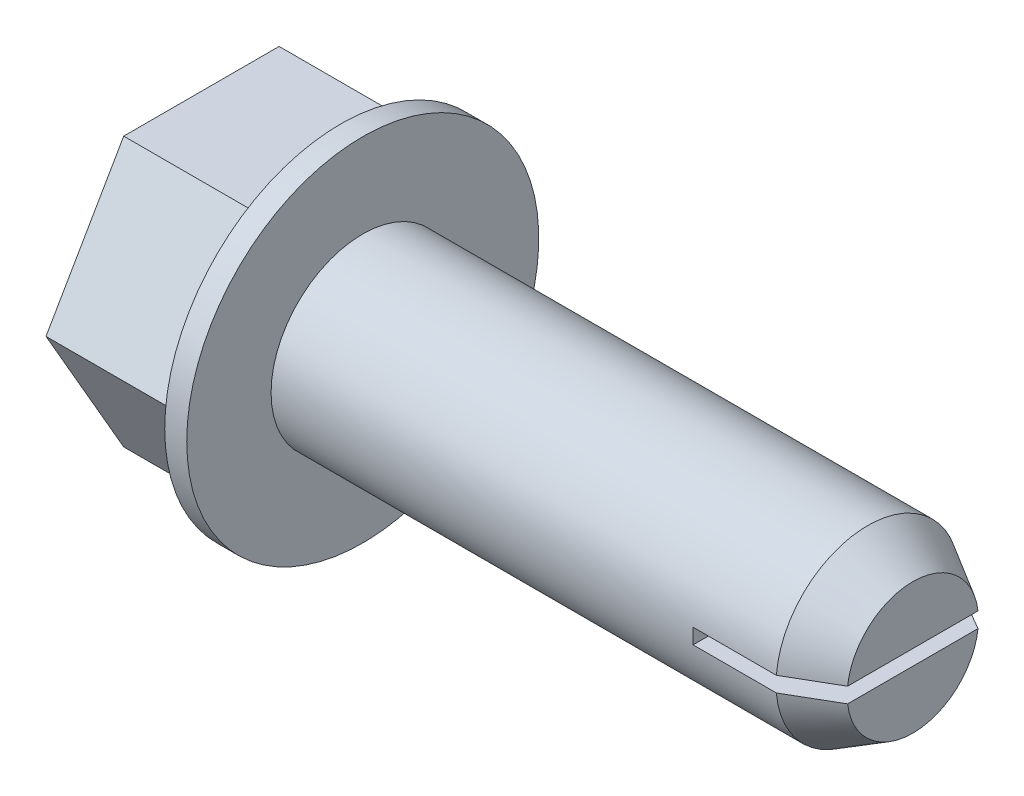
ISO-10303-21;
HEADER;
FILE_DESCRIPTION(('STEP AP214'),'2;1');
FILE_NAME('part.step','',(''),(''),'','','');
FILE_SCHEMA(('AUTOMOTIVE_DESIGN { 1 0 10303 214 1 1 1 1 }'));
ENDSEC;
DATA;
#1=APPLICATION_CONTEXT('core data for automotive mechanical design processes');
#2=APPLICATION_PROTOCOL_DEFINITION('international standard','automotive_design',2000,#1);
#3=PRODUCT_CONTEXT('',#1,'mechanical');
#4=PRODUCT('Part','Part','',(#3));
#5=PRODUCT_RELATED_PRODUCT_CATEGORY('part','',(#4));
#6=PRODUCT_DEFINITION_FORMATION('','',#4);
#7=PRODUCT_DEFINITION_CONTEXT('part definition',#1,'design');
#8=PRODUCT_DEFINITION('design','',#6,#7);
#9=PRODUCT_DEFINITION_SHAPE('','',#8);
#10=(LENGTH_UNIT() NAMED_UNIT(*) SI_UNIT(.MILLI.,.METRE.));
#11=(NAMED_UNIT(*) PLANE_ANGLE_UNIT() SI_UNIT($,.RADIAN.));
#12=(NAMED_UNIT(*) SI_UNIT($,.STERADIAN.) SOLID_ANGLE_UNIT());
#13=UNCERTAINTY_MEASURE_WITH_UNIT(LENGTH_MEASURE(1.E-05),#10,'distance_accuracy_value','');
#14=(GEOMETRIC_REPRESENTATION_CONTEXT(3) GLOBAL_UNCERTAINTY_ASSIGNED_CONTEXT((#13)) GLOBAL_UNIT_ASSIGNED_CONTEXT((#10,
#11,#12)) REPRESENTATION_CONTEXT('',''));
#15=CARTESIAN_POINT('',(0.,0.,0.));
#16=DIRECTION('',(0.,0.,1.));
#17=DIRECTION('',(1.,0.,0.));
#18=AXIS2_PLACEMENT_3D('',#15,#16,#17);
#19=CARTESIAN_POINT('',(-4.6228,3.72872,0.));
#20=DIRECTION('',(1.,0.,0.));
#21=DIRECTION('',(0.,0.,-1.));
#22=AXIS2_PLACEMENT_3D('',#19,#20,#21);
#23=PLANE('',#22);
#24=CARTESIAN_POINT('',(-4.6228,0.,0.));
#25=DIRECTION('',(-1.,0.,0.));
#26=DIRECTION('',(0.,0.,1.));
#27=AXIS2_PLACEMENT_3D('',#24,#25,#26);
#28=CIRCLE('',#27,3.72872);
#29=CARTESIAN_POINT('',(-4.6228,0.,3.72872));
#30=VERTEX_POINT('',#29);
#31=EDGE_CURVE('E19',#30,#30,#28,.T.);
#32=ORIENTED_EDGE('',*,*,#31,.T.);
#33=EDGE_LOOP('',(#32));
#34=FACE_BOUND('',#33,.T.);
#35=ADVANCED_FACE('F16',(#34),#23,.F.);
#36=CARTESIAN_POINT('',(0.,0.,0.));
#37=DIRECTION('',(-1.,0.,0.));
#38=DIRECTION('',(0.,0.,1.));
#39=AXIS2_PLACEMENT_3D('',#36,#37,#38);
#40=CYLINDRICAL_SURFACE('',#39,3.72872);
#41=ORIENTED_EDGE('',*,*,#31,.F.);
#42=EDGE_LOOP('',(#41));
#43=FACE_BOUND('',#42,.T.);
#44=CARTESIAN_POINT('',(-5.588,0.,0.));
#45=DIRECTION('',(-1.,0.,0.));
#46=DIRECTION('',(0.,0.,1.));
#47=AXIS2_PLACEMENT_3D('',#44,#45,#46);
#48=CIRCLE('',#47,3.72872);
#49=CARTESIAN_POINT('',(-5.588,0.,3.72872));
#50=VERTEX_POINT('',#49);
#51=EDGE_CURVE('E151',#50,#50,#48,.T.);
#52=ORIENTED_EDGE('',*,*,#51,.T.);
#53=EDGE_LOOP('',(#52));
#54=FACE_BOUND('',#53,.T.);
#55=ADVANCED_FACE('F250',(#43,#54),#40,.F.);
#56=CARTESIAN_POINT('',(-5.588,4.6609,0.));
#57=DIRECTION('',(1.,0.,0.));
#58=DIRECTION('',(0.,0.,-1.));
#59=AXIS2_PLACEMENT_3D('',#56,#57,#58);
#60=PLANE('',#59);
#61=DIRECTION('',(0.,0.,-1.));
#62=VECTOR('',#61,1.);
#63=CARTESIAN_POINT('',(-5.58799999998882,-4.6609,0.));
#64=LINE('',#63,#62);
#65=CARTESIAN_POINT('',(-5.58800000007968,-4.6609,2.69097186966593));
#66=VERTEX_POINT('',#65);
#67=CARTESIAN_POINT('',(-5.58799999999441,-4.6609,-2.69097186966593));
#68=VERTEX_POINT('',#67);
#69=EDGE_CURVE('E147',#66,#68,#64,.T.);
#70=ORIENTED_EDGE('',*,*,#69,.F.);
#71=DIRECTION('',(0.,-0.866025403784439,-0.5));
#72=VECTOR('',#71,1.);
#73=CARTESIAN_POINT('',(-5.5880000002162,-10.7431892055105,-0.820639440424718));
#74=LINE('',#73,#72);
#75=CARTESIAN_POINT('',(-5.58800000007968,0.,5.38194373933185));
#76=VERTEX_POINT('',#75);
#77=EDGE_CURVE('E142',#76,#66,#74,.T.);
#78=ORIENTED_EDGE('',*,*,#77,.F.);
#79=DIRECTION('',(0.,-0.866025403784439,0.5));
#80=VECTOR('',#79,1.);
#81=CARTESIAN_POINT('',(-5.58799999998882,-6.08228920551051,8.8935550494225));
#82=LINE('',#81,#80);
#83=CARTESIAN_POINT('',(-5.58799999999441,4.6609,2.69097186966593));
#84=VERTEX_POINT('',#83);
#85=EDGE_CURVE('E138',#84,#76,#82,.T.);
#86=ORIENTED_EDGE('',*,*,#85,.F.);
#87=DIRECTION('',(0.,0.,1.));
#88=VECTOR('',#87,1.);
#89=CARTESIAN_POINT('',(-5.58799999998882,4.6609,0.));
#90=LINE('',#89,#88);
#91=CARTESIAN_POINT('',(-5.58800000007968,4.6609,-2.69097186966593));
#92=VERTEX_POINT('',#91);
#93=EDGE_CURVE('E161',#92,#84,#90,.T.);
#94=ORIENTED_EDGE('',*,*,#93,.F.);
#95=DIRECTION('',(0.,0.866025403784439,0.5));
#96=VECTOR('',#95,1.);
#97=CARTESIAN_POINT('',(-5.5880000002162,-6.08228920551051,-8.8935550494225));
#98=LINE('',#97,#96);
#99=CARTESIAN_POINT('',(-5.58800000016215,0.,-5.38194373933185));
#100=VERTEX_POINT('',#99);
#101=EDGE_CURVE('E338',#100,#92,#98,.T.);
#102=ORIENTED_EDGE('',*,*,#101,.F.);
#103=DIRECTION('',(0.,0.866025403784439,-0.5));
#104=VECTOR('',#103,1.);
#105=CARTESIAN_POINT('',(-5.58799999998882,-10.7431892055105,0.82063944042472));
#106=LINE('',#105,#104);
#107=EDGE_CURVE('E328',#68,#100,#106,.T.);
#108=ORIENTED_EDGE('',*,*,#107,.F.);
#109=EDGE_LOOP('',(#70,#78,#86,#94,#102,#108));
#110=FACE_BOUND('',#109,.T.);
#111=ORIENTED_EDGE('',*,*,#51,.F.);
#112=EDGE_LOOP('',(#111));
#113=FACE_BOUND('',#112,.T.);
#114=ADVANCED_FACE('F144',(#110,#113),#60,.F.);
#115=CARTESIAN_POINT('',(500000.,-10.7431892055105,-0.820639440424718));
#116=DIRECTION('',(0.,-0.5,0.866025403784439));
#117=DIRECTION('',(0.,-0.866025403784439,-0.5));
#118=AXIS2_PLACEMENT_3D('',#115,#116,#117);
#119=PLANE('',#118);
#120=DIRECTION('',(0.,0.866025403784439,0.5));
#121=VECTOR('',#120,1.);
#122=CARTESIAN_POINT('',(-0.762,-4.6609,2.69097186966593));
#123=LINE('',#122,#121);
#124=CARTESIAN_POINT('',(-0.762000000091873,-4.6609,2.69097186966593));
#125=VERTEX_POINT('',#124);
#126=CARTESIAN_POINT('',(-0.762000000177139,0.,5.38194373933185));
#127=VERTEX_POINT('',#126);
#128=EDGE_CURVE('E157',#125,#127,#123,.T.);
#129=ORIENTED_EDGE('',*,*,#128,.T.);
#130=DIRECTION('',(1.,0.,0.));
#131=VECTOR('',#130,1.);
#132=CARTESIAN_POINT('',(500000.,0.,5.38194373933185));
#133=LINE('',#132,#131);
#134=EDGE_CURVE('E154',#76,#127,#133,.T.);
#135=ORIENTED_EDGE('',*,*,#134,.F.);
#136=ORIENTED_EDGE('',*,*,#77,.T.);
#137=DIRECTION('',(1.,0.,0.));
#138=VECTOR('',#137,1.);
#139=CARTESIAN_POINT('',(500000.,-4.6609,2.69097186966593));
#140=LINE('',#139,#138);
#141=EDGE_CURVE('E320',#125,#66,#140,.F.);
#142=ORIENTED_EDGE('',*,*,#141,.F.);
#143=EDGE_LOOP('',(#129,#135,#136,#142));
#144=FACE_BOUND('',#143,.T.);
#145=ADVANCED_FACE('F155',(#144),#119,.T.);
#146=CARTESIAN_POINT('',(500000.,-6.08228920551051,8.8935550494225));
#147=DIRECTION('',(0.,0.5,0.866025403784439));
#148=DIRECTION('',(0.,-0.866025403784439,0.5));
#149=AXIS2_PLACEMENT_3D('',#146,#147,#148);
#150=PLANE('',#149);
#151=DIRECTION('',(0.,0.866025403784439,-0.5));
#152=VECTOR('',#151,1.);
#153=CARTESIAN_POINT('',(-0.762,0.,5.38194373933185));
#154=LINE('',#153,#152);
#155=CARTESIAN_POINT('',(-0.762000000006608,4.6609,2.69097186966593));
#156=VERTEX_POINT('',#155);
#157=EDGE_CURVE('E315',#127,#156,#154,.T.);
#158=ORIENTED_EDGE('',*,*,#157,.T.);
#159=DIRECTION('',(1.,0.,0.));
#160=VECTOR('',#159,1.);
#161=CARTESIAN_POINT('',(500000.,4.6609,2.69097186966592));
#162=LINE('',#161,#160);
#163=EDGE_CURVE('E165',#84,#156,#162,.T.);
#164=ORIENTED_EDGE('',*,*,#163,.F.);
#165=ORIENTED_EDGE('',*,*,#85,.T.);
#166=ORIENTED_EDGE('',*,*,#134,.T.);
#167=EDGE_LOOP('',(#158,#164,#165,#166));
#168=FACE_BOUND('',#167,.T.);
#169=ADVANCED_FACE('F163',(#168),#150,.T.);
#170=CARTESIAN_POINT('',(500000.,4.6609,0.));
#171=DIRECTION('',(0.,1.,0.));
#172=DIRECTION('',(0.,0.,1.));
#173=AXIS2_PLACEMENT_3D('',#170,#171,#172);
#174=PLANE('',#173);
#175=DIRECTION('',(0.,0.,-1.));
#176=VECTOR('',#175,1.);
#177=CARTESIAN_POINT('',(-0.762,4.6609,0.));
#178=LINE('',#177,#176);
#179=CARTESIAN_POINT('',(-0.762000000049241,4.6609,-2.69097186966592));
#180=VERTEX_POINT('',#179);
#181=EDGE_CURVE('E312',#156,#180,#178,.T.);
#182=ORIENTED_EDGE('',*,*,#181,.T.);
#183=DIRECTION('',(1.,0.,0.));
#184=VECTOR('',#183,1.);
#185=CARTESIAN_POINT('',(500000.,4.6609,-2.69097186966592));
#186=LINE('',#185,#184);
#187=EDGE_CURVE('E335',#92,#180,#186,.T.);
#188=ORIENTED_EDGE('',*,*,#187,.F.);
#189=ORIENTED_EDGE('',*,*,#93,.T.);
#190=ORIENTED_EDGE('',*,*,#163,.T.);
#191=EDGE_LOOP('',(#182,#188,#189,#190));
#192=FACE_BOUND('',#191,.T.);
#193=ADVANCED_FACE('F345',(#192),#174,.T.);
#194=CARTESIAN_POINT('',(500000.,-6.08228920551051,-8.8935550494225));
#195=DIRECTION('',(0.,0.5,-0.866025403784439));
#196=DIRECTION('',(0.,0.866025403784439,0.5));
#197=AXIS2_PLACEMENT_3D('',#194,#195,#196);
#198=PLANE('',#197);
#199=DIRECTION('',(0.,-0.866025403784439,-0.5));
#200=VECTOR('',#199,1.);
#201=CARTESIAN_POINT('',(-0.762,4.6609,-2.69097186966593));
#202=LINE('',#201,#200);
#203=CARTESIAN_POINT('',(-0.762000000148717,0.,-5.38194373933185));
#204=VERTEX_POINT('',#203);
#205=EDGE_CURVE('E309',#180,#204,#202,.T.);
#206=ORIENTED_EDGE('',*,*,#205,.T.);
#207=DIRECTION('',(1.,0.,0.));
#208=VECTOR('',#207,1.);
#209=CARTESIAN_POINT('',(500000.,0.,-5.38194373933185));
#210=LINE('',#209,#208);
#211=EDGE_CURVE('E332',#100,#204,#210,.T.);
#212=ORIENTED_EDGE('',*,*,#211,.F.);
#213=ORIENTED_EDGE('',*,*,#101,.T.);
#214=ORIENTED_EDGE('',*,*,#187,.T.);
#215=EDGE_LOOP('',(#206,#212,#213,#214));
#216=FACE_BOUND('',#215,.T.);
#217=ADVANCED_FACE('F349',(#216),#198,.T.);
#218=CARTESIAN_POINT('',(500000.,-10.7431892055105,0.82063944042472));
#219=DIRECTION('',(0.,-0.5,-0.866025403784439));
#220=DIRECTION('',(0.,0.866025403784439,-0.5));
#221=AXIS2_PLACEMENT_3D('',#218,#219,#220);
#222=PLANE('',#221);
#223=DIRECTION('',(1.,0.,0.));
#224=VECTOR('',#223,1.);
#225=CARTESIAN_POINT('',(500000.,-4.6609,-2.69097186966593));
#226=LINE('',#225,#224);
#227=CARTESIAN_POINT('',(-0.761999999949765,-4.6609,-2.69097186966593));
#228=VERTEX_POINT('',#227);
#229=EDGE_CURVE('E323',#68,#228,#226,.T.);
#230=ORIENTED_EDGE('',*,*,#229,.F.);
#231=ORIENTED_EDGE('',*,*,#107,.T.);
#232=ORIENTED_EDGE('',*,*,#211,.T.);
#233=DIRECTION('',(0.,-0.866025403784439,0.499999999999999));
#234=VECTOR('',#233,1.);
#235=CARTESIAN_POINT('',(-0.762,0.,-5.38194373933185));
#236=LINE('',#235,#234);
#237=EDGE_CURVE('E99',#204,#228,#236,.T.);
#238=ORIENTED_EDGE('',*,*,#237,.T.);
#239=EDGE_LOOP('',(#230,#231,#232,#238));
#240=FACE_BOUND('',#239,.T.);
#241=ADVANCED_FACE('F351',(#240),#222,.T.);
#242=CARTESIAN_POINT('',(500000.,-4.6609,0.));
#243=DIRECTION('',(0.,-1.,0.));
#244=DIRECTION('',(0.,0.,-1.));
#245=AXIS2_PLACEMENT_3D('',#242,#243,#244);
#246=PLANE('',#245);
#247=DIRECTION('',(0.,0.,-1.));
#248=VECTOR('',#247,1.);
#249=CARTESIAN_POINT('',(-0.762,-4.6609,0.));
#250=LINE('',#249,#248);
#251=EDGE_CURVE('E239',#228,#125,#250,.F.);
#252=ORIENTED_EDGE('',*,*,#251,.T.);
#253=ORIENTED_EDGE('',*,*,#141,.T.);
#254=ORIENTED_EDGE('',*,*,#69,.T.);
#255=ORIENTED_EDGE('',*,*,#229,.T.);
#256=EDGE_LOOP('',(#252,#253,#254,#255));
#257=FACE_BOUND('',#256,.T.);
#258=ADVANCED_FACE('F354',(#257),#246,.T.);
#259=CARTESIAN_POINT('',(-0.762,6.096,0.));
#260=DIRECTION('',(1.,0.,0.));
#261=DIRECTION('',(0.,0.,-1.));
#262=AXIS2_PLACEMENT_3D('',#259,#260,#261);
#263=PLANE('',#262);
#264=CARTESIAN_POINT('',(-0.762,0.,0.));
#265=DIRECTION('',(-1.,0.,0.));
#266=DIRECTION('',(0.,0.,1.));
#267=AXIS2_PLACEMENT_3D('',#264,#265,#266);
#268=CIRCLE('',#267,6.096);
#269=CARTESIAN_POINT('',(-0.762,0.,6.096));
#270=VERTEX_POINT('',#269);
#271=EDGE_CURVE('E236',#270,#270,#268,.F.);
#272=ORIENTED_EDGE('',*,*,#271,.F.);
#273=EDGE_LOOP('',(#272));
#274=FACE_BOUND('',#273,.T.);
#275=ORIENTED_EDGE('',*,*,#237,.F.);
#276=ORIENTED_EDGE('',*,*,#205,.F.);
#277=ORIENTED_EDGE('',*,*,#181,.F.);
#278=ORIENTED_EDGE('',*,*,#157,.F.);
#279=ORIENTED_EDGE('',*,*,#128,.F.);
#280=ORIENTED_EDGE('',*,*,#251,.F.);
#281=EDGE_LOOP('',(#275,#276,#277,#278,#279,#280));
#282=FACE_BOUND('',#281,.T.);
#283=ADVANCED_FACE('F356',(#274,#282),#263,.F.);
#284=CARTESIAN_POINT('',(19.05,3.175,0.));
#285=DIRECTION('',(-1.,0.,0.));
#286=DIRECTION('',(0.,0.,1.));
#287=AXIS2_PLACEMENT_3D('',#284,#285,#286);
#288=PLANE('',#287);
#289=DIRECTION('',(0.,0.,-1.));
#290=VECTOR('',#289,1.);
#291=CARTESIAN_POINT('',(19.05,-0.264583333333333,-6.096));
#292=LINE('',#291,#290);
#293=CARTESIAN_POINT('',(19.0500000000004,-0.264583333333333,-2.25785042680903));
#294=VERTEX_POINT('',#293);
#295=CARTESIAN_POINT('',(19.0499999999965,-0.264583333333333,2.25785042681133));
#296=VERTEX_POINT('',#295);
#297=EDGE_CURVE('E233',#294,#296,#292,.F.);
#298=ORIENTED_EDGE('',*,*,#297,.T.);
#299=CARTESIAN_POINT('',(19.0499999999929,0.,0.));
#300=DIRECTION('',(-1.,0.,0.));
#301=DIRECTION('',(0.,0.,1.));
#302=AXIS2_PLACEMENT_3D('',#299,#300,#301);
#303=CIRCLE('',#302,2.27330000003061);
#304=EDGE_CURVE('E87',#294,#296,#303,.T.);
#305=ORIENTED_EDGE('',*,*,#304,.F.);
#306=EDGE_LOOP('',(#298,#305));
#307=FACE_BOUND('',#306,.T.);
#308=ADVANCED_FACE('F358',(#307),#288,.F.);
#309=CARTESIAN_POINT('',(0.,0.,0.));
#310=DIRECTION('',(-1.,0.,0.));
#311=DIRECTION('',(0.,0.,1.));
#312=AXIS2_PLACEMENT_3D('',#309,#310,#311);
#313=CYLINDRICAL_SURFACE('',#312,6.096);
#314=ORIENTED_EDGE('',*,*,#271,.T.);
#315=EDGE_LOOP('',(#314));
#316=FACE_BOUND('',#315,.T.);
#317=CARTESIAN_POINT('',(0.,0.,0.));
#318=DIRECTION('',(-1.,0.,0.));
#319=DIRECTION('',(0.,0.,1.));
#320=AXIS2_PLACEMENT_3D('',#317,#318,#319);
#321=CIRCLE('',#320,6.096);
#322=CARTESIAN_POINT('',(0.,0.,6.096));
#323=VERTEX_POINT('',#322);
#324=EDGE_CURVE('E283',#323,#323,#321,.T.);
#325=ORIENTED_EDGE('',*,*,#324,.T.);
#326=EDGE_LOOP('',(#325));
#327=FACE_BOUND('',#326,.T.);
#328=ADVANCED_FACE('F365',(#316,#327),#313,.T.);
#329=CARTESIAN_POINT('',(17.488209787075,0.,0.));
#330=DIRECTION('',(-1.,0.,0.));
#331=DIRECTION('',(0.,0.,1.));
#332=AXIS2_PLACEMENT_3D('',#329,#330,#331);
#333=CONICAL_SURFACE('',#332,3.17499999988513,0.523598775602448);
#334=CARTESIAN_POINT('',(17.4882097868304,-0.264583333333333,-3.16395648830533));
#335=CARTESIAN_POINT('',(17.7485950521458,-0.264583333333333,-3.01308870934584));
#336=CARTESIAN_POINT('',(18.0089562455111,-0.264583333333333,-2.86217927282826));
#337=CARTESIAN_POINT('',(18.3994183217583,-0.264583333333333,-2.63567773139847));
#338=CARTESIAN_POINT('',(18.5295590617472,-0.264583333333333,-2.56015431969282));
#339=CARTESIAN_POINT('',(18.7898067189707,-0.264583333333333,-2.40904920796175));
#340=CARTESIAN_POINT('',(18.9199136362009,-0.264583333333333,-2.333467507929));
#341=CARTESIAN_POINT('',(19.0500000000079,-0.264583333333333,-2.25785042680467));
#342=B_SPLINE_CURVE_WITH_KNOTS('',3,(#334,#335,#336,#337,#338,#339,#340,#341),.UNSPECIFIED.,.F.,
.F.,(4,2,2,4),(0.,0.902803568709945,1.35420535449983,1.80560719706211),.UNSPECIFIED.);
#343=CARTESIAN_POINT('',(17.4882097868228,-0.264583333333333,-3.16395648829212));
#344=VERTEX_POINT('',#343);
#345=EDGE_CURVE('E227',#344,#294,#342,.T.);
#346=ORIENTED_EDGE('',*,*,#345,.T.);
#347=ORIENTED_EDGE('',*,*,#304,.T.);
#348=CARTESIAN_POINT('',(19.0500000000073,-0.264583333333333,2.257850426805));
#349=CARTESIAN_POINT('',(18.9199136362004,-0.264583333333333,2.3334675079293));
#350=CARTESIAN_POINT('',(18.7898067189702,-0.264583333333333,2.40904920796202));
#351=CARTESIAN_POINT('',(18.5295590617469,-0.264583333333333,2.56015431969304));
#352=CARTESIAN_POINT('',(18.3994183217579,-0.264583333333333,2.63567773139866));
#353=CARTESIAN_POINT('',(18.0089562455109,-0.264583333333333,2.86217927282837));
#354=CARTESIAN_POINT('',(17.7485950521457,-0.264583333333333,3.01308870934589));
#355=CARTESIAN_POINT('',(17.4882097868304,-0.264583333333333,3.16395648830533));
#356=B_SPLINE_CURVE_WITH_KNOTS('',3,(#348,#349,#350,#351,#352,#353,#354,#355),.UNSPECIFIED.,.F.,
.F.,(4,2,2,4),(0.,0.451401842562117,0.902803628351839,1.80560719706146),.UNSPECIFIED.);
#357=CARTESIAN_POINT('',(17.4882097868228,-0.264583333333333,3.16395648829212));
#358=VERTEX_POINT('',#357);
#359=EDGE_CURVE('E221',#296,#358,#356,.T.);
#360=ORIENTED_EDGE('',*,*,#359,.T.);
#361=CARTESIAN_POINT('',(17.4882097868151,0.,0.));
#362=DIRECTION('',(-1.,0.,0.));
#363=DIRECTION('',(0.,0.,1.));
#364=AXIS2_PLACEMENT_3D('',#361,#362,#363);
#365=CIRCLE('',#364,3.175);
#366=EDGE_CURVE('E293',#344,#358,#365,.T.);
#367=ORIENTED_EDGE('',*,*,#366,.F.);
#368=EDGE_LOOP('',(#346,#347,#360,#367));
#369=FACE_BOUND('',#368,.T.);
#370=ADVANCED_FACE('F215',(#369),#333,.T.);
#371=CARTESIAN_POINT('',(14.605,-0.264583333333333,-6.096));
#372=DIRECTION('',(0.,-1.,0.));
#373=DIRECTION('',(0.,0.,-1.));
#374=AXIS2_PLACEMENT_3D('',#371,#372,#373);
#375=PLANE('',#374);
#376=ORIENTED_EDGE('',*,*,#297,.F.);
#377=ORIENTED_EDGE('',*,*,#345,.F.);
#378=DIRECTION('',(-1.,0.,0.));
#379=VECTOR('',#378,1.);
#380=CARTESIAN_POINT('',(0.,-0.264583333333333,-3.16395648827891));
#381=LINE('',#380,#379);
#382=CARTESIAN_POINT('',(14.605,-0.264583333333333,-3.16395648827891));
#383=VERTEX_POINT('',#382);
#384=EDGE_CURVE('E297',#383,#344,#381,.F.);
#385=ORIENTED_EDGE('',*,*,#384,.F.);
#386=DIRECTION('',(0.,0.,1.));
#387=VECTOR('',#386,1.);
#388=CARTESIAN_POINT('',(14.605,-0.264583333333333,-6.096));
#389=LINE('',#388,#387);
#390=CARTESIAN_POINT('',(14.605,-0.264583333333333,3.16395648827891));
#391=VERTEX_POINT('',#390);
#392=EDGE_CURVE('E280',#383,#391,#389,.T.);
#393=ORIENTED_EDGE('',*,*,#392,.T.);
#394=DIRECTION('',(-1.,0.,0.));
#395=VECTOR('',#394,1.);
#396=CARTESIAN_POINT('',(0.,-0.264583333333333,3.16395648827891));
#397=LINE('',#396,#395);
#398=EDGE_CURVE('E288',#358,#391,#397,.T.);
#399=ORIENTED_EDGE('',*,*,#398,.F.);
#400=ORIENTED_EDGE('',*,*,#359,.F.);
#401=EDGE_LOOP('',(#376,#377,#385,#393,#399,#400));
#402=FACE_BOUND('',#401,.T.);
#403=ADVANCED_FACE('F210',(#402),#375,.F.);
#404=CARTESIAN_POINT('',(14.605,0.264583333333333,-6.096));
#405=DIRECTION('',(-1.,0.,0.));
#406=DIRECTION('',(0.,0.,1.));
#407=AXIS2_PLACEMENT_3D('',#404,#405,#406);
#408=PLANE('',#407);
#409=DIRECTION('',(0.,0.,1.));
#410=VECTOR('',#409,1.);
#411=CARTESIAN_POINT('',(14.605,0.264583333333333,-6.096));
#412=LINE('',#411,#410);
#413=CARTESIAN_POINT('',(14.605,0.264583333333334,-3.16395648827891));
#414=VERTEX_POINT('',#413);
#415=CARTESIAN_POINT('',(14.605,0.264583333333333,3.16395648827891));
#416=VERTEX_POINT('',#415);
#417=EDGE_CURVE('E284',#414,#416,#412,.T.);
#418=ORIENTED_EDGE('',*,*,#417,.T.);
#419=CARTESIAN_POINT('',(14.605,0.,0.));
#420=DIRECTION('',(-1.,0.,0.));
#421=DIRECTION('',(0.,0.,1.));
#422=AXIS2_PLACEMENT_3D('',#419,#420,#421);
#423=CIRCLE('',#422,3.175);
#424=EDGE_CURVE('E292',#391,#416,#423,.T.);
#425=ORIENTED_EDGE('',*,*,#424,.F.);
#426=ORIENTED_EDGE('',*,*,#392,.F.);
#427=CARTESIAN_POINT('',(14.605,0.,0.));
#428=DIRECTION('',(-1.,0.,0.));
#429=DIRECTION('',(0.,0.,1.));
#430=AXIS2_PLACEMENT_3D('',#427,#428,#429);
#431=CIRCLE('',#430,3.175);
#432=EDGE_CURVE('E301',#414,#383,#431,.T.);
#433=ORIENTED_EDGE('',*,*,#432,.F.);
#434=EDGE_LOOP('',(#418,#425,#426,#433));
#435=FACE_BOUND('',#434,.T.);
#436=ADVANCED_FACE('F206',(#435),#408,.F.);
#437=CARTESIAN_POINT('',(19.05,3.175,0.));
#438=DIRECTION('',(-1.,0.,0.));
#439=DIRECTION('',(0.,0.,1.));
#440=AXIS2_PLACEMENT_3D('',#437,#438,#439);
#441=PLANE('',#440);
#442=DIRECTION('',(0.,0.,1.));
#443=VECTOR('',#442,1.);
#444=CARTESIAN_POINT('',(19.05,0.264583333333333,-6.096));
#445=LINE('',#444,#443);
#446=CARTESIAN_POINT('',(19.0500000000004,0.264583333333333,2.25785042680903));
#447=VERTEX_POINT('',#446);
#448=CARTESIAN_POINT('',(19.0499999999965,0.264583333333333,-2.25785042681133));
#449=VERTEX_POINT('',#448);
#450=EDGE_CURVE('E185',#447,#449,#445,.F.);
#451=ORIENTED_EDGE('',*,*,#450,.T.);
#452=CARTESIAN_POINT('',(19.0499999999929,0.,0.));
#453=DIRECTION('',(-1.,0.,0.));
#454=DIRECTION('',(0.,0.,1.));
#455=AXIS2_PLACEMENT_3D('',#452,#453,#454);
#456=CIRCLE('',#455,2.27330000003061);
#457=EDGE_CURVE('E287',#447,#449,#456,.T.);
#458=ORIENTED_EDGE('',*,*,#457,.F.);
#459=EDGE_LOOP('',(#451,#458));
#460=FACE_BOUND('',#459,.T.);
#461=ADVANCED_FACE('F202',(#460),#441,.F.);
#462=CARTESIAN_POINT('',(0.,3.175,0.));
#463=DIRECTION('',(-1.,0.,0.));
#464=DIRECTION('',(0.,0.,1.));
#465=AXIS2_PLACEMENT_3D('',#462,#463,#464);
#466=PLANE('',#465);
#467=CARTESIAN_POINT('',(0.,0.,0.));
#468=DIRECTION('',(-1.,0.,0.));
#469=DIRECTION('',(0.,0.,1.));
#470=AXIS2_PLACEMENT_3D('',#467,#468,#469);
#471=CIRCLE('',#470,3.175);
#472=CARTESIAN_POINT('',(0.,0.,3.175));
#473=VERTEX_POINT('',#472);
#474=EDGE_CURVE('E173',#473,#473,#471,.F.);
#475=ORIENTED_EDGE('',*,*,#474,.F.);
#476=EDGE_LOOP('',(#475));
#477=FACE_BOUND('',#476,.T.);
#478=ORIENTED_EDGE('',*,*,#324,.F.);
#479=EDGE_LOOP('',(#478));
#480=FACE_BOUND('',#479,.T.);
#481=ADVANCED_FACE('F198',(#477,#480),#466,.F.);
#482=CARTESIAN_POINT('',(17.488209787075,0.,0.));
#483=DIRECTION('',(-1.,0.,0.));
#484=DIRECTION('',(0.,0.,1.));
#485=AXIS2_PLACEMENT_3D('',#482,#483,#484);
#486=CONICAL_SURFACE('',#485,3.17499999988513,0.523598775602448);
#487=CARTESIAN_POINT('',(17.4882097868351,0.264583333333333,3.16395648830265));
#488=CARTESIAN_POINT('',(17.7485950521496,0.264583333333333,3.0130887093436));
#489=CARTESIAN_POINT('',(18.0089562455142,0.264583333333333,2.86217927282647));
#490=CARTESIAN_POINT('',(18.3994183217602,0.264583333333333,2.63567773139735));
#491=CARTESIAN_POINT('',(18.5295590617488,0.264583333333333,2.56015431969193));
#492=CARTESIAN_POINT('',(18.7898067189715,0.264583333333333,2.40904920796131));
#493=CARTESIAN_POINT('',(18.9199136362013,0.264583333333333,2.33346750792877));
#494=CARTESIAN_POINT('',(19.0500000000079,0.264583333333333,2.25785042680467));
#495=B_SPLINE_CURVE_WITH_KNOTS('',3,(#487,#488,#489,#490,#491,#492,#493,#494),.UNSPECIFIED.,.F.,
.F.,(4,2,2,4),(0.,0.902803568707271,1.35420535449581,1.80560719705676),.UNSPECIFIED.);
#496=CARTESIAN_POINT('',(17.4882097868251,0.264583333333333,3.16395648829078));
#497=VERTEX_POINT('',#496);
#498=EDGE_CURVE('E186',#497,#447,#495,.T.);
#499=ORIENTED_EDGE('',*,*,#498,.T.);
#500=ORIENTED_EDGE('',*,*,#457,.T.);
#501=CARTESIAN_POINT('',(19.0500000000051,0.264583333333333,-2.25785042680627));
#502=CARTESIAN_POINT('',(18.9199136361991,0.264583333333333,-2.33346750793001));
#503=CARTESIAN_POINT('',(18.7898067189699,0.264583333333333,-2.40904920796219));
#504=CARTESIAN_POINT('',(18.5295590617485,0.264583333333333,-2.5601543196921));
#505=CARTESIAN_POINT('',(18.3994183217605,0.264583333333333,-2.63567773139716));
#506=CARTESIAN_POINT('',(18.0089562455164,0.264583333333333,-2.86217927282522));
#507=CARTESIAN_POINT('',(17.748595052153,0.264583333333333,-3.01308870934164));
#508=CARTESIAN_POINT('',(17.4882097868397,0.264583333333333,-3.16395648829997));
#509=B_SPLINE_CURVE_WITH_KNOTS('',3,(#501,#502,#503,#504,#505,#506,#507,#508),.UNSPECIFIED.,.F.,
.F.,(4,2,2,4),(0.,0.451401842558815,0.902803628345232,1.80560719704824),.UNSPECIFIED.);
#510=CARTESIAN_POINT('',(17.4882097868274,0.264583333333334,-3.16395648828944));
#511=VERTEX_POINT('',#510);
#512=EDGE_CURVE('E39',#449,#511,#509,.T.);
#513=ORIENTED_EDGE('',*,*,#512,.T.);
#514=CARTESIAN_POINT('',(17.4882097868151,0.,0.));
#515=DIRECTION('',(-1.,0.,0.));
#516=DIRECTION('',(0.,0.,1.));
#517=AXIS2_PLACEMENT_3D('',#514,#515,#516);
#518=CIRCLE('',#517,3.175);
#519=EDGE_CURVE('E26',#497,#511,#518,.T.);
#520=ORIENTED_EDGE('',*,*,#519,.F.);
#521=EDGE_LOOP('',(#499,#500,#513,#520));
#522=FACE_BOUND('',#521,.T.);
#523=ADVANCED_FACE('F194',(#522),#486,.T.);
#524=CARTESIAN_POINT('',(14.605,0.264583333333333,-6.096));
#525=DIRECTION('',(0.,1.,0.));
#526=DIRECTION('',(0.,0.,1.));
#527=AXIS2_PLACEMENT_3D('',#524,#525,#526);
#528=PLANE('',#527);
#529=ORIENTED_EDGE('',*,*,#450,.F.);
#530=ORIENTED_EDGE('',*,*,#498,.F.);
#531=DIRECTION('',(-1.,0.,0.));
#532=VECTOR('',#531,1.);
#533=CARTESIAN_POINT('',(0.,0.264583333333334,3.16395648827891));
#534=LINE('',#533,#532);
#535=EDGE_CURVE('E177',#416,#497,#534,.F.);
#536=ORIENTED_EDGE('',*,*,#535,.F.);
#537=ORIENTED_EDGE('',*,*,#417,.F.);
#538=DIRECTION('',(-1.,0.,0.));
#539=VECTOR('',#538,1.);
#540=CARTESIAN_POINT('',(0.,0.264583333333334,-3.16395648827891));
#541=LINE('',#540,#539);
#542=EDGE_CURVE('E11',#511,#414,#541,.T.);
#543=ORIENTED_EDGE('',*,*,#542,.F.);
#544=ORIENTED_EDGE('',*,*,#512,.F.);
#545=EDGE_LOOP('',(#529,#530,#536,#537,#543,#544));
#546=FACE_BOUND('',#545,.T.);
#547=ADVANCED_FACE('F191',(#546),#528,.F.);
#548=CARTESIAN_POINT('',(0.,0.,0.));
#549=DIRECTION('',(-1.,0.,0.));
#550=DIRECTION('',(0.,0.,1.));
#551=AXIS2_PLACEMENT_3D('',#548,#549,#550);
#552=CYLINDRICAL_SURFACE('',#551,3.175);
#553=ORIENTED_EDGE('',*,*,#474,.T.);
#554=EDGE_LOOP('',(#553));
#555=FACE_BOUND('',#554,.T.);
#556=ORIENTED_EDGE('',*,*,#519,.T.);
#557=ORIENTED_EDGE('',*,*,#542,.T.);
#558=ORIENTED_EDGE('',*,*,#432,.T.);
#559=ORIENTED_EDGE('',*,*,#384,.T.);
#560=ORIENTED_EDGE('',*,*,#366,.T.);
#561=ORIENTED_EDGE('',*,*,#398,.T.);
#562=ORIENTED_EDGE('',*,*,#424,.T.);
#563=ORIENTED_EDGE('',*,*,#535,.T.);
#564=EDGE_LOOP('',(#556,#557,#558,#559,#560,#561,#562,#563));
#565=FACE_BOUND('',#564,.T.);
#566=ADVANCED_FACE('F258',(#555,#565),#552,.T.);
#567=CLOSED_SHELL('',(#35,#55,#114,#145,#169,#193,#217,#241,#258,#283,#308,#328,#370,#403,#436,
#461,#481,#523,#547,#566));
#568=MANIFOLD_SOLID_BREP('B1',#567);
#569=ADVANCED_BREP_SHAPE_REPRESENTATION('',(#18,#568),#14);
#570=SHAPE_DEFINITION_REPRESENTATION(#9,#569);
ENDSEC;
END-ISO-10303-21;
